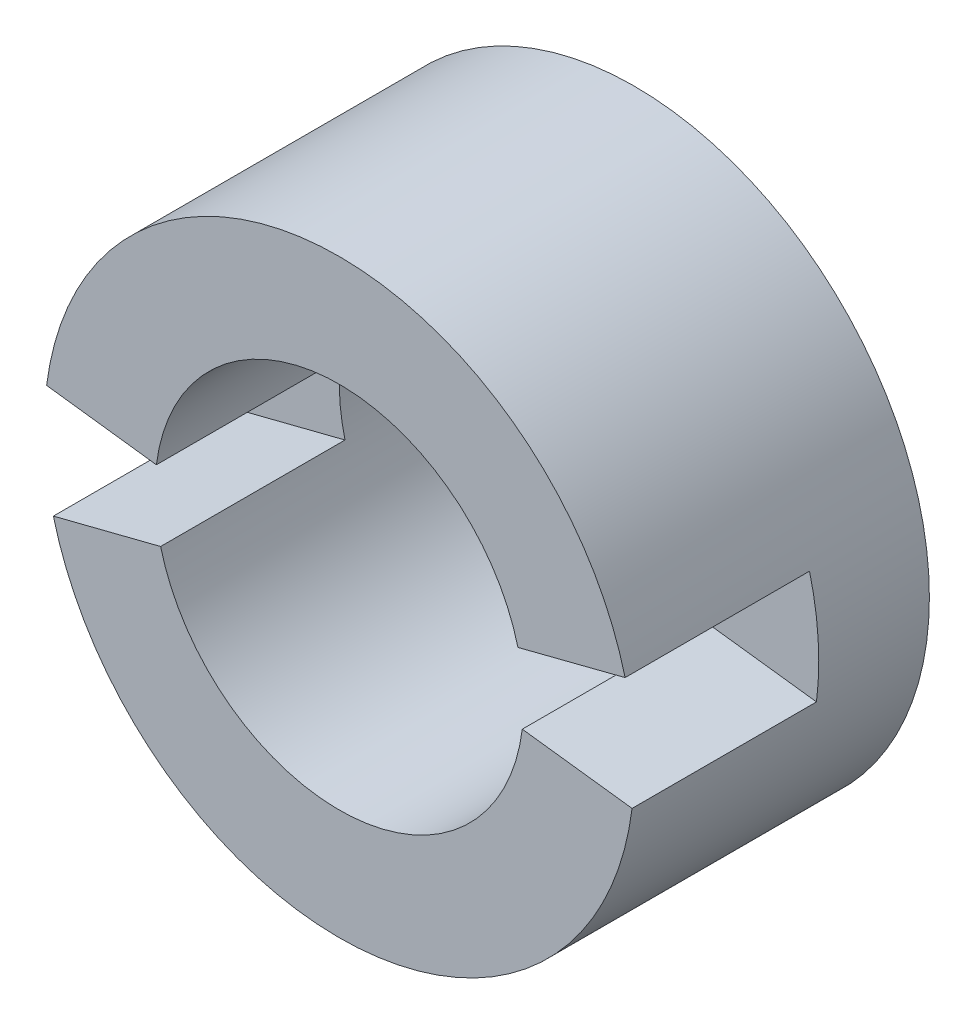
ISO-10303-21;
HEADER;
FILE_DESCRIPTION(('STEP AP214'),'2;1');
FILE_NAME('part.step','',(''),(''),'','','');
FILE_SCHEMA(('AUTOMOTIVE_DESIGN { 1 0 10303 214 1 1 1 1 }'));
ENDSEC;
DATA;
#1=APPLICATION_CONTEXT('core data for automotive mechanical design processes');
#2=APPLICATION_PROTOCOL_DEFINITION('international standard','automotive_design',2000,#1);
#3=PRODUCT_CONTEXT('',#1,'mechanical');
#4=PRODUCT('Part','Part','',(#3));
#5=PRODUCT_RELATED_PRODUCT_CATEGORY('part','',(#4));
#6=PRODUCT_DEFINITION_FORMATION('','',#4);
#7=PRODUCT_DEFINITION_CONTEXT('part definition',#1,'design');
#8=PRODUCT_DEFINITION('design','',#6,#7);
#9=PRODUCT_DEFINITION_SHAPE('','',#8);
#10=(LENGTH_UNIT() NAMED_UNIT(*) SI_UNIT(.MILLI.,.METRE.));
#11=(NAMED_UNIT(*) PLANE_ANGLE_UNIT() SI_UNIT($,.RADIAN.));
#12=(NAMED_UNIT(*) SI_UNIT($,.STERADIAN.) SOLID_ANGLE_UNIT());
#13=UNCERTAINTY_MEASURE_WITH_UNIT(LENGTH_MEASURE(1.E-05),#10,'distance_accuracy_value','');
#14=(GEOMETRIC_REPRESENTATION_CONTEXT(3) GLOBAL_UNCERTAINTY_ASSIGNED_CONTEXT((#13)) GLOBAL_UNIT_ASSIGNED_CONTEXT((#10,
#11,#12)) REPRESENTATION_CONTEXT('',''));
#15=CARTESIAN_POINT('',(0.,0.,0.));
#16=DIRECTION('',(0.,0.,1.));
#17=DIRECTION('',(1.,0.,0.));
#18=AXIS2_PLACEMENT_3D('',#15,#16,#17);
#19=CARTESIAN_POINT('',(0.,0.,8.));
#20=DIRECTION('',(0.,0.,1.));
#21=DIRECTION('',(1.,0.,0.));
#22=AXIS2_PLACEMENT_3D('',#19,#20,#21);
#23=PLANE('',#22);
#24=DIRECTION('',(-0.992098070814687,0.12546480735958,0.));
#25=VECTOR('',#24,1.);
#26=CARTESIAN_POINT('',(-7.93678456651749,1.00371845887664,8.));
#27=LINE('',#26,#25);
#28=CARTESIAN_POINT('',(-4.96049035407344,0.627324036797901,8.));
#29=VERTEX_POINT('',#28);
#30=CARTESIAN_POINT('',(-7.93678456651749,1.00371845887664,8.));
#31=VERTEX_POINT('',#30);
#32=EDGE_CURVE('E158',#29,#31,#27,.T.);
#33=ORIENTED_EDGE('',*,*,#32,.F.);
#34=CARTESIAN_POINT('',(0.,0.,8.));
#35=DIRECTION('',(0.,0.,1.));
#36=DIRECTION('',(1.,0.,0.));
#37=AXIS2_PLACEMENT_3D('',#34,#35,#36);
#38=CIRCLE('',#37,5.);
#39=CARTESIAN_POINT('',(4.84357550059133,1.24087725826187,8.));
#40=VERTEX_POINT('',#39);
#41=EDGE_CURVE('E182',#40,#29,#38,.T.);
#42=ORIENTED_EDGE('',*,*,#41,.F.);
#43=DIRECTION('',(0.968715100118265,0.248175451652373,0.));
#44=VECTOR('',#43,1.);
#45=CARTESIAN_POINT('',(7.74972080094612,1.98540361321898,8.));
#46=LINE('',#45,#44);
#47=CARTESIAN_POINT('',(7.74972080094612,1.98540361321898,8.));
#48=VERTEX_POINT('',#47);
#49=EDGE_CURVE('E176',#40,#48,#46,.T.);
#50=ORIENTED_EDGE('',*,*,#49,.T.);
#51=CARTESIAN_POINT('',(0.,0.,8.));
#52=DIRECTION('',(0.,0.,1.));
#53=DIRECTION('',(1.,0.,0.));
#54=AXIS2_PLACEMENT_3D('',#51,#52,#53);
#55=CIRCLE('',#54,8.);
#56=EDGE_CURVE('E189',#48,#31,#55,.T.);
#57=ORIENTED_EDGE('',*,*,#56,.T.);
#58=EDGE_LOOP('',(#33,#42,#50,#57));
#59=FACE_BOUND('',#58,.T.);
#60=ADVANCED_FACE('F69',(#59),#23,.T.);
#61=DIRECTION('',(-0.969109128880456,-0.246632309968834,0.));
#62=VECTOR('',#61,1.);
#63=CARTESIAN_POINT('',(-7.75287303104365,-1.97305847975067,8.));
#64=LINE('',#63,#62);
#65=CARTESIAN_POINT('',(-4.84554564440228,-1.23316154984417,8.));
#66=VERTEX_POINT('',#65);
#67=CARTESIAN_POINT('',(-7.75287303104365,-1.97305847975067,8.));
#68=VERTEX_POINT('',#67);
#69=EDGE_CURVE('E84',#66,#68,#64,.T.);
#70=ORIENTED_EDGE('',*,*,#69,.T.);
#71=CARTESIAN_POINT('',(7.93837307564306,-0.991076642800792,8.));
#72=VERTEX_POINT('',#71);
#73=EDGE_CURVE('E153',#68,#72,#55,.T.);
#74=ORIENTED_EDGE('',*,*,#73,.T.);
#75=DIRECTION('',(0.992296634455383,-0.123884580350099,0.));
#76=VECTOR('',#75,1.);
#77=CARTESIAN_POINT('',(7.93837307564306,-0.991076642800792,8.));
#78=LINE('',#77,#76);
#79=CARTESIAN_POINT('',(4.96148317227691,-0.619422901750495,8.));
#80=VERTEX_POINT('',#79);
#81=EDGE_CURVE('E173',#80,#72,#78,.T.);
#82=ORIENTED_EDGE('',*,*,#81,.F.);
#83=EDGE_CURVE('E186',#66,#80,#38,.T.);
#84=ORIENTED_EDGE('',*,*,#83,.F.);
#85=EDGE_LOOP('',(#70,#74,#82,#84));
#86=FACE_BOUND('',#85,.T.);
#87=ADVANCED_FACE('F224',(#86),#23,.T.);
#88=CARTESIAN_POINT('',(0.,0.,0.));
#89=DIRECTION('',(0.,0.,1.));
#90=DIRECTION('',(1.,0.,0.));
#91=AXIS2_PLACEMENT_3D('',#88,#89,#90);
#92=PLANE('',#91);
#93=CARTESIAN_POINT('',(0.,0.,0.));
#94=DIRECTION('',(0.,0.,1.));
#95=DIRECTION('',(1.,0.,0.));
#96=AXIS2_PLACEMENT_3D('',#93,#94,#95);
#97=CIRCLE('',#96,8.);
#98=CARTESIAN_POINT('',(8.,0.,0.));
#99=VERTEX_POINT('',#98);
#100=EDGE_CURVE('E185',#99,#99,#97,.T.);
#101=ORIENTED_EDGE('',*,*,#100,.F.);
#102=EDGE_LOOP('',(#101));
#103=FACE_BOUND('',#102,.T.);
#104=CARTESIAN_POINT('',(0.,0.,0.));
#105=DIRECTION('',(0.,0.,1.));
#106=DIRECTION('',(1.,0.,0.));
#107=AXIS2_PLACEMENT_3D('',#104,#105,#106);
#108=CIRCLE('',#107,5.);
#109=CARTESIAN_POINT('',(5.,0.,0.));
#110=VERTEX_POINT('',#109);
#111=EDGE_CURVE('E180',#110,#110,#108,.T.);
#112=ORIENTED_EDGE('',*,*,#111,.T.);
#113=EDGE_LOOP('',(#112));
#114=FACE_BOUND('',#113,.T.);
#115=ADVANCED_FACE('F226',(#103,#114),#92,.F.);
#116=CARTESIAN_POINT('',(0.,0.,8.));
#117=DIRECTION('',(0.,0.,-1.));
#118=DIRECTION('',(-1.,0.,0.));
#119=AXIS2_PLACEMENT_3D('',#116,#117,#118);
#120=CYLINDRICAL_SURFACE('',#119,8.);
#121=CARTESIAN_POINT('',(0.,0.,3.));
#122=DIRECTION('',(0.,0.,-1.));
#123=DIRECTION('',(-0.992098070814687,0.12546480735958,0.));
#124=AXIS2_PLACEMENT_3D('',#121,#122,#123);
#125=CIRCLE('',#124,8.);
#126=CARTESIAN_POINT('',(-7.75287303104365,-1.97305847975067,3.));
#127=VERTEX_POINT('',#126);
#128=CARTESIAN_POINT('',(-7.93678456651749,1.00371845887664,3.));
#129=VERTEX_POINT('',#128);
#130=EDGE_CURVE('E143',#127,#129,#125,.T.);
#131=ORIENTED_EDGE('',*,*,#130,.T.);
#132=DIRECTION('',(0.,0.,-1.));
#133=VECTOR('',#132,1.);
#134=CARTESIAN_POINT('',(-7.93678456651749,1.00371845887664,8.));
#135=LINE('',#134,#133);
#136=EDGE_CURVE('E140',#31,#129,#135,.T.);
#137=ORIENTED_EDGE('',*,*,#136,.F.);
#138=ORIENTED_EDGE('',*,*,#56,.F.);
#139=DIRECTION('',(0.,0.,1.));
#140=VECTOR('',#139,1.);
#141=CARTESIAN_POINT('',(7.74972080094612,1.98540361321898,3.));
#142=LINE('',#141,#140);
#143=CARTESIAN_POINT('',(7.74972080094612,1.98540361321899,3.));
#144=VERTEX_POINT('',#143);
#145=EDGE_CURVE('E166',#144,#48,#142,.T.);
#146=ORIENTED_EDGE('',*,*,#145,.F.);
#147=CARTESIAN_POINT('',(0.,0.,3.));
#148=DIRECTION('',(0.,0.,-1.));
#149=DIRECTION('',(0.992296634455383,-0.123884580350098,0.));
#150=AXIS2_PLACEMENT_3D('',#147,#148,#149);
#151=CIRCLE('',#150,8.);
#152=CARTESIAN_POINT('',(7.93837307564306,-0.991076642800787,3.));
#153=VERTEX_POINT('',#152);
#154=EDGE_CURVE('E162',#144,#153,#151,.T.);
#155=ORIENTED_EDGE('',*,*,#154,.T.);
#156=DIRECTION('',(0.,0.,-1.));
#157=VECTOR('',#156,1.);
#158=CARTESIAN_POINT('',(7.93837307564306,-0.991076642800787,7.99999999999999));
#159=LINE('',#158,#157);
#160=EDGE_CURVE('E160',#72,#153,#159,.T.);
#161=ORIENTED_EDGE('',*,*,#160,.F.);
#162=ORIENTED_EDGE('',*,*,#73,.F.);
#163=DIRECTION('',(0.,0.,1.));
#164=VECTOR('',#163,1.);
#165=CARTESIAN_POINT('',(-7.75287303104365,-1.97305847975067,3.));
#166=LINE('',#165,#164);
#167=EDGE_CURVE('E135',#127,#68,#166,.T.);
#168=ORIENTED_EDGE('',*,*,#167,.F.);
#169=EDGE_LOOP('',(#131,#137,#138,#146,#155,#161,#162,#168));
#170=FACE_BOUND('',#169,.T.);
#171=ORIENTED_EDGE('',*,*,#100,.T.);
#172=EDGE_LOOP('',(#171));
#173=FACE_BOUND('',#172,.T.);
#174=ADVANCED_FACE('F71',(#170,#173),#120,.T.);
#175=CARTESIAN_POINT('',(0.,0.,8.));
#176=DIRECTION('',(0.,0.,-1.));
#177=DIRECTION('',(-1.,0.,0.));
#178=AXIS2_PLACEMENT_3D('',#175,#176,#177);
#179=CYLINDRICAL_SURFACE('',#178,5.);
#180=DIRECTION('',(0.,0.,-1.));
#181=VECTOR('',#180,1.);
#182=CARTESIAN_POINT('',(-4.96049035407344,0.627324036797901,8.));
#183=LINE('',#182,#181);
#184=CARTESIAN_POINT('',(-4.96049035407344,0.627324036797901,3.));
#185=VERTEX_POINT('',#184);
#186=EDGE_CURVE('E13',#185,#29,#183,.F.);
#187=ORIENTED_EDGE('',*,*,#186,.F.);
#188=CARTESIAN_POINT('',(0.,0.,3.));
#189=DIRECTION('',(0.,0.,1.));
#190=DIRECTION('',(1.,0.,0.));
#191=AXIS2_PLACEMENT_3D('',#188,#189,#190);
#192=CIRCLE('',#191,5.);
#193=CARTESIAN_POINT('',(-4.84554564440228,-1.23316154984417,3.));
#194=VERTEX_POINT('',#193);
#195=EDGE_CURVE('E77',#194,#185,#192,.F.);
#196=ORIENTED_EDGE('',*,*,#195,.F.);
#197=DIRECTION('',(0.,0.,-1.));
#198=VECTOR('',#197,1.);
#199=CARTESIAN_POINT('',(-4.84554564440228,-1.23316154984417,8.));
#200=LINE('',#199,#198);
#201=EDGE_CURVE('E136',#66,#194,#200,.T.);
#202=ORIENTED_EDGE('',*,*,#201,.F.);
#203=ORIENTED_EDGE('',*,*,#83,.T.);
#204=DIRECTION('',(0.,0.,-1.));
#205=VECTOR('',#204,1.);
#206=CARTESIAN_POINT('',(4.96148317227692,-0.619422901750492,8.));
#207=LINE('',#206,#205);
#208=CARTESIAN_POINT('',(4.96148317227692,-0.619422901750492,3.));
#209=VERTEX_POINT('',#208);
#210=EDGE_CURVE('E196',#209,#80,#207,.F.);
#211=ORIENTED_EDGE('',*,*,#210,.F.);
#212=CARTESIAN_POINT('',(0.,0.,3.));
#213=DIRECTION('',(0.,0.,1.));
#214=DIRECTION('',(1.,0.,0.));
#215=AXIS2_PLACEMENT_3D('',#212,#213,#214);
#216=CIRCLE('',#215,5.);
#217=CARTESIAN_POINT('',(4.84357550059133,1.24087725826187,3.));
#218=VERTEX_POINT('',#217);
#219=EDGE_CURVE('E192',#218,#209,#216,.F.);
#220=ORIENTED_EDGE('',*,*,#219,.F.);
#221=DIRECTION('',(0.,0.,-1.));
#222=VECTOR('',#221,1.);
#223=CARTESIAN_POINT('',(4.84357550059133,1.24087725826187,8.));
#224=LINE('',#223,#222);
#225=EDGE_CURVE('E199',#40,#218,#224,.T.);
#226=ORIENTED_EDGE('',*,*,#225,.F.);
#227=ORIENTED_EDGE('',*,*,#41,.T.);
#228=EDGE_LOOP('',(#187,#196,#202,#203,#211,#220,#226,#227));
#229=FACE_BOUND('',#228,.T.);
#230=ORIENTED_EDGE('',*,*,#111,.F.);
#231=EDGE_LOOP('',(#230));
#232=FACE_BOUND('',#231,.T.);
#233=ADVANCED_FACE('F206',(#229,#232),#179,.F.);
#234=CARTESIAN_POINT('',(7.74972080094612,1.98540361321898,5.5));
#235=DIRECTION('',(-0.248175451652373,0.968715100118265,0.));
#236=DIRECTION('',(0.,0.,1.));
#237=AXIS2_PLACEMENT_3D('',#234,#235,#236);
#238=PLANE('',#237);
#239=ORIENTED_EDGE('',*,*,#225,.T.);
#240=DIRECTION('',(0.968715100118265,0.248175451652373,0.));
#241=VECTOR('',#240,1.);
#242=CARTESIAN_POINT('',(7.74972080094612,1.98540361321899,3.));
#243=LINE('',#242,#241);
#244=EDGE_CURVE('E92',#218,#144,#243,.T.);
#245=ORIENTED_EDGE('',*,*,#244,.T.);
#246=ORIENTED_EDGE('',*,*,#145,.T.);
#247=ORIENTED_EDGE('',*,*,#49,.F.);
#248=EDGE_LOOP('',(#239,#245,#246,#247));
#249=FACE_BOUND('',#248,.T.);
#250=ADVANCED_FACE('F215',(#249),#238,.F.);
#251=CARTESIAN_POINT('',(7.93837307564306,-0.991076642800787,5.5));
#252=DIRECTION('',(-0.123884580350098,-0.992296634455383,0.));
#253=DIRECTION('',(0.,0.,-1.));
#254=AXIS2_PLACEMENT_3D('',#251,#252,#253);
#255=PLANE('',#254);
#256=ORIENTED_EDGE('',*,*,#210,.T.);
#257=ORIENTED_EDGE('',*,*,#81,.T.);
#258=ORIENTED_EDGE('',*,*,#160,.T.);
#259=DIRECTION('',(0.992296634455383,-0.123884580350098,0.));
#260=VECTOR('',#259,1.);
#261=CARTESIAN_POINT('',(7.93837307564306,-0.991076642800787,3.));
#262=LINE('',#261,#260);
#263=EDGE_CURVE('E169',#209,#153,#262,.T.);
#264=ORIENTED_EDGE('',*,*,#263,.F.);
#265=EDGE_LOOP('',(#256,#257,#258,#264));
#266=FACE_BOUND('',#265,.T.);
#267=ADVANCED_FACE('F220',(#266),#255,.F.);
#268=CARTESIAN_POINT('',(0.,0.,3.));
#269=DIRECTION('',(0.,0.,1.));
#270=DIRECTION('',(1.,0.,0.));
#271=AXIS2_PLACEMENT_3D('',#268,#269,#270);
#272=PLANE('',#271);
#273=ORIENTED_EDGE('',*,*,#219,.T.);
#274=ORIENTED_EDGE('',*,*,#263,.T.);
#275=ORIENTED_EDGE('',*,*,#154,.F.);
#276=ORIENTED_EDGE('',*,*,#244,.F.);
#277=EDGE_LOOP('',(#273,#274,#275,#276));
#278=FACE_BOUND('',#277,.T.);
#279=ADVANCED_FACE('F216',(#278),#272,.T.);
#280=CARTESIAN_POINT('',(-7.93678456651749,1.00371845887664,5.5));
#281=DIRECTION('',(0.12546480735958,0.992098070814687,0.));
#282=DIRECTION('',(0.,0.,-1.));
#283=AXIS2_PLACEMENT_3D('',#280,#281,#282);
#284=PLANE('',#283);
#285=ORIENTED_EDGE('',*,*,#186,.T.);
#286=ORIENTED_EDGE('',*,*,#32,.T.);
#287=ORIENTED_EDGE('',*,*,#136,.T.);
#288=DIRECTION('',(-0.992098070814687,0.12546480735958,0.));
#289=VECTOR('',#288,1.);
#290=CARTESIAN_POINT('',(-7.93678456651749,1.00371845887664,3.));
#291=LINE('',#290,#289);
#292=EDGE_CURVE('E139',#185,#129,#291,.T.);
#293=ORIENTED_EDGE('',*,*,#292,.F.);
#294=EDGE_LOOP('',(#285,#286,#287,#293));
#295=FACE_BOUND('',#294,.T.);
#296=ADVANCED_FACE('F204',(#295),#284,.F.);
#297=CARTESIAN_POINT('',(0.,0.,3.));
#298=DIRECTION('',(0.,0.,1.));
#299=DIRECTION('',(1.,0.,0.));
#300=AXIS2_PLACEMENT_3D('',#297,#298,#299);
#301=PLANE('',#300);
#302=ORIENTED_EDGE('',*,*,#195,.T.);
#303=ORIENTED_EDGE('',*,*,#292,.T.);
#304=ORIENTED_EDGE('',*,*,#130,.F.);
#305=DIRECTION('',(-0.969109128880456,-0.246632309968834,0.));
#306=VECTOR('',#305,1.);
#307=CARTESIAN_POINT('',(-7.75287303104365,-1.97305847975067,3.));
#308=LINE('',#307,#306);
#309=EDGE_CURVE('E131',#194,#127,#308,.T.);
#310=ORIENTED_EDGE('',*,*,#309,.F.);
#311=EDGE_LOOP('',(#302,#303,#304,#310));
#312=FACE_BOUND('',#311,.T.);
#313=ADVANCED_FACE('F144',(#312),#301,.T.);
#314=CARTESIAN_POINT('',(-7.75287303104365,-1.97305847975067,5.5));
#315=DIRECTION('',(0.246632309968834,-0.969109128880456,0.));
#316=DIRECTION('',(0.,0.,1.));
#317=AXIS2_PLACEMENT_3D('',#314,#315,#316);
#318=PLANE('',#317);
#319=ORIENTED_EDGE('',*,*,#201,.T.);
#320=ORIENTED_EDGE('',*,*,#309,.T.);
#321=ORIENTED_EDGE('',*,*,#167,.T.);
#322=ORIENTED_EDGE('',*,*,#69,.F.);
#323=EDGE_LOOP('',(#319,#320,#321,#322));
#324=FACE_BOUND('',#323,.T.);
#325=ADVANCED_FACE('F133',(#324),#318,.F.);
#326=CLOSED_SHELL('',(#60,#87,#115,#174,#233,#250,#267,#279,#296,#313,#325));
#327=MANIFOLD_SOLID_BREP('B2',#326);
#328=ADVANCED_BREP_SHAPE_REPRESENTATION('',(#18,#327),#14);
#329=SHAPE_DEFINITION_REPRESENTATION(#9,#328);
ENDSEC;
END-ISO-10303-21;
